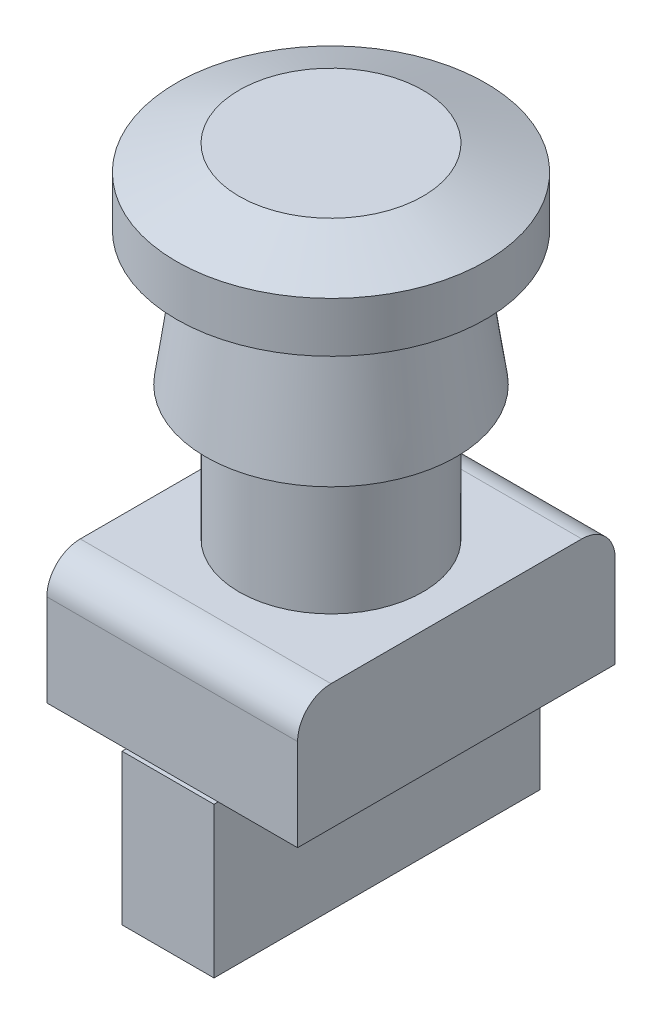
ISO-10303-21;
HEADER;
FILE_DESCRIPTION(('STEP AP214'),'2;1');
FILE_NAME('part.step','',(''),(''),'','','');
FILE_SCHEMA(('AUTOMOTIVE_DESIGN { 1 0 10303 214 1 1 1 1 }'));
ENDSEC;
DATA;
#1=APPLICATION_CONTEXT('core data for automotive mechanical design processes');
#2=APPLICATION_PROTOCOL_DEFINITION('international standard','automotive_design',2000,#1);
#3=PRODUCT_CONTEXT('',#1,'mechanical');
#4=PRODUCT('Part','Part','',(#3));
#5=PRODUCT_RELATED_PRODUCT_CATEGORY('part','',(#4));
#6=PRODUCT_DEFINITION_FORMATION('','',#4);
#7=PRODUCT_DEFINITION_CONTEXT('part definition',#1,'design');
#8=PRODUCT_DEFINITION('design','',#6,#7);
#9=PRODUCT_DEFINITION_SHAPE('','',#8);
#10=(LENGTH_UNIT() NAMED_UNIT(*) SI_UNIT(.MILLI.,.METRE.));
#11=(NAMED_UNIT(*) PLANE_ANGLE_UNIT() SI_UNIT($,.RADIAN.));
#12=(NAMED_UNIT(*) SI_UNIT($,.STERADIAN.) SOLID_ANGLE_UNIT());
#13=UNCERTAINTY_MEASURE_WITH_UNIT(LENGTH_MEASURE(1.E-05),#10,'distance_accuracy_value','');
#14=(GEOMETRIC_REPRESENTATION_CONTEXT(3) GLOBAL_UNCERTAINTY_ASSIGNED_CONTEXT((#13)) GLOBAL_UNIT_ASSIGNED_CONTEXT((#10,
#11,#12)) REPRESENTATION_CONTEXT('',''));
#15=CARTESIAN_POINT('',(0.,0.,0.));
#16=DIRECTION('',(0.,0.,1.));
#17=DIRECTION('',(1.,0.,0.));
#18=AXIS2_PLACEMENT_3D('',#15,#16,#17);
#19=CARTESIAN_POINT('',(0.,-31.,0.));
#20=DIRECTION('',(0.,1.,0.));
#21=DIRECTION('',(0.,0.,1.));
#22=AXIS2_PLACEMENT_3D('',#19,#20,#21);
#23=PLANE('',#22);
#24=DIRECTION('',(0.,0.,-1.));
#25=VECTOR('',#24,1.);
#26=CARTESIAN_POINT('',(-5.5,-31.,0.));
#27=LINE('',#26,#25);
#28=CARTESIAN_POINT('',(-5.5,-31.,19.));
#29=VERTEX_POINT('',#28);
#30=CARTESIAN_POINT('',(-5.5,-31.,-19.));
#31=VERTEX_POINT('',#30);
#32=EDGE_CURVE('E171',#29,#31,#27,.T.);
#33=ORIENTED_EDGE('',*,*,#32,.F.);
#34=DIRECTION('',(1.,0.,0.));
#35=VECTOR('',#34,1.);
#36=CARTESIAN_POINT('',(0.,-31.,19.));
#37=LINE('',#36,#35);
#38=CARTESIAN_POINT('',(-15.,-31.,19.));
#39=VERTEX_POINT('',#38);
#40=EDGE_CURVE('E176',#39,#29,#37,.T.);
#41=ORIENTED_EDGE('',*,*,#40,.F.);
#42=DIRECTION('',(0.,0.,-1.));
#43=VECTOR('',#42,1.);
#44=CARTESIAN_POINT('',(-15.,-31.,0.));
#45=LINE('',#44,#43);
#46=CARTESIAN_POINT('',(-15.,-31.,-19.));
#47=VERTEX_POINT('',#46);
#48=EDGE_CURVE('E188',#39,#47,#45,.T.);
#49=ORIENTED_EDGE('',*,*,#48,.T.);
#50=DIRECTION('',(1.,0.,0.));
#51=VECTOR('',#50,1.);
#52=CARTESIAN_POINT('',(0.,-31.,-19.));
#53=LINE('',#52,#51);
#54=EDGE_CURVE('E185',#47,#31,#53,.T.);
#55=ORIENTED_EDGE('',*,*,#54,.T.);
#56=EDGE_LOOP('',(#33,#41,#49,#55));
#57=FACE_BOUND('',#56,.T.);
#58=ADVANCED_FACE('F33',(#57),#23,.F.);
#59=CARTESIAN_POINT('',(0.,0.,0.));
#60=DIRECTION('',(0.,-1.,0.));
#61=DIRECTION('',(0.,0.,1.));
#62=AXIS2_PLACEMENT_3D('',#59,#60,#61);
#63=CONICAL_SURFACE('',#62,15.,0.139626340159547);
#64=CARTESIAN_POINT('',(0.,15.,0.));
#65=DIRECTION('',(0.,1.,0.));
#66=DIRECTION('',(0.,0.,1.));
#67=AXIS2_PLACEMENT_3D('',#64,#65,#66);
#68=CIRCLE('',#67,12.8918874794641);
#69=CARTESIAN_POINT('',(0.,15.,12.8918874794641));
#70=VERTEX_POINT('',#69);
#71=EDGE_CURVE('E213',#70,#70,#68,.T.);
#72=ORIENTED_EDGE('',*,*,#71,.F.);
#73=EDGE_LOOP('',(#72));
#74=FACE_BOUND('',#73,.T.);
#75=CARTESIAN_POINT('',(0.,0.,0.));
#76=DIRECTION('',(0.,1.,0.));
#77=DIRECTION('',(0.,0.,1.));
#78=AXIS2_PLACEMENT_3D('',#75,#76,#77);
#79=CIRCLE('',#78,15.);
#80=CARTESIAN_POINT('',(0.,0.,15.));
#81=VERTEX_POINT('',#80);
#82=EDGE_CURVE('E210',#81,#81,#79,.T.);
#83=ORIENTED_EDGE('',*,*,#82,.T.);
#84=EDGE_LOOP('',(#83));
#85=FACE_BOUND('',#84,.T.);
#86=ADVANCED_FACE('F262',(#74,#85),#63,.T.);
#87=CARTESIAN_POINT('',(0.,15.,0.));
#88=DIRECTION('',(0.,1.,0.));
#89=DIRECTION('',(0.,0.,1.));
#90=AXIS2_PLACEMENT_3D('',#87,#88,#89);
#91=PLANE('',#90);
#92=CARTESIAN_POINT('',(0.,15.,0.));
#93=DIRECTION('',(0.,1.,0.));
#94=DIRECTION('',(0.,0.,1.));
#95=AXIS2_PLACEMENT_3D('',#92,#93,#94);
#96=CIRCLE('',#95,12.);
#97=CARTESIAN_POINT('',(0.,15.,12.));
#98=VERTEX_POINT('',#97);
#99=EDGE_CURVE('E219',#98,#98,#96,.T.);
#100=ORIENTED_EDGE('',*,*,#99,.F.);
#101=EDGE_LOOP('',(#100));
#102=FACE_BOUND('',#101,.T.);
#103=ORIENTED_EDGE('',*,*,#71,.T.);
#104=EDGE_LOOP('',(#103));
#105=FACE_BOUND('',#104,.T.);
#106=ADVANCED_FACE('F268',(#102,#105),#91,.T.);
#107=CARTESIAN_POINT('',(0.,0.,0.));
#108=DIRECTION('',(0.,1.,0.));
#109=DIRECTION('',(0.,0.,1.));
#110=AXIS2_PLACEMENT_3D('',#107,#108,#109);
#111=PLANE('',#110);
#112=CARTESIAN_POINT('',(0.,0.,0.));
#113=DIRECTION('',(0.,1.,0.));
#114=DIRECTION('',(0.,0.,1.));
#115=AXIS2_PLACEMENT_3D('',#112,#113,#114);
#116=CIRCLE('',#115,11.);
#117=CARTESIAN_POINT('',(0.,0.,11.));
#118=VERTEX_POINT('',#117);
#119=EDGE_CURVE('E207',#118,#118,#116,.T.);
#120=ORIENTED_EDGE('',*,*,#119,.T.);
#121=EDGE_LOOP('',(#120));
#122=FACE_BOUND('',#121,.T.);
#123=ORIENTED_EDGE('',*,*,#82,.F.);
#124=EDGE_LOOP('',(#123));
#125=FACE_BOUND('',#124,.T.);
#126=ADVANCED_FACE('F293',(#122,#125),#111,.F.);
#127=CARTESIAN_POINT('',(0.,-16.,0.));
#128=DIRECTION('',(0.,1.,0.));
#129=DIRECTION('',(0.,0.,1.));
#130=AXIS2_PLACEMENT_3D('',#127,#128,#129);
#131=CYLINDRICAL_SURFACE('',#130,11.);
#132=CARTESIAN_POINT('',(0.,-16.,0.));
#133=DIRECTION('',(0.,1.,0.));
#134=DIRECTION('',(0.,0.,1.));
#135=AXIS2_PLACEMENT_3D('',#132,#133,#134);
#136=CIRCLE('',#135,11.);
#137=CARTESIAN_POINT('',(0.,-16.,11.));
#138=VERTEX_POINT('',#137);
#139=EDGE_CURVE('E198',#138,#138,#136,.T.);
#140=ORIENTED_EDGE('',*,*,#139,.T.);
#141=EDGE_LOOP('',(#140));
#142=FACE_BOUND('',#141,.T.);
#143=ORIENTED_EDGE('',*,*,#119,.F.);
#144=EDGE_LOOP('',(#143));
#145=FACE_BOUND('',#144,.T.);
#146=ADVANCED_FACE('F290',(#142,#145),#131,.T.);
#147=CARTESIAN_POINT('',(0.,-31.,19.));
#148=DIRECTION('',(0.,0.,1.));
#149=DIRECTION('',(1.,0.,0.));
#150=AXIS2_PLACEMENT_3D('',#147,#148,#149);
#151=PLANE('',#150);
#152=DIRECTION('',(0.,1.,0.));
#153=VECTOR('',#152,1.);
#154=CARTESIAN_POINT('',(15.,-31.,19.));
#155=LINE('',#154,#153);
#156=CARTESIAN_POINT('',(15.,-31.,19.));
#157=VERTEX_POINT('',#156);
#158=CARTESIAN_POINT('',(15.,-20.,19.));
#159=VERTEX_POINT('',#158);
#160=EDGE_CURVE('E191',#157,#159,#155,.T.);
#161=ORIENTED_EDGE('',*,*,#160,.T.);
#162=DIRECTION('',(1.,0.,0.));
#163=VECTOR('',#162,1.);
#164=CARTESIAN_POINT('',(0.,-20.,19.));
#165=LINE('',#164,#163);
#166=CARTESIAN_POINT('',(-15.,-20.,19.));
#167=VERTEX_POINT('',#166);
#168=EDGE_CURVE('E56',#159,#167,#165,.F.);
#169=ORIENTED_EDGE('',*,*,#168,.T.);
#170=DIRECTION('',(0.,1.,0.));
#171=VECTOR('',#170,1.);
#172=CARTESIAN_POINT('',(-15.,-31.,19.));
#173=LINE('',#172,#171);
#174=EDGE_CURVE('E196',#39,#167,#173,.T.);
#175=ORIENTED_EDGE('',*,*,#174,.F.);
#176=ORIENTED_EDGE('',*,*,#40,.T.);
#177=CARTESIAN_POINT('',(5.5,-31.,19.));
#178=VERTEX_POINT('',#177);
#179=EDGE_CURVE('E180',#29,#178,#37,.T.);
#180=ORIENTED_EDGE('',*,*,#179,.T.);
#181=EDGE_CURVE('E181',#178,#157,#37,.T.);
#182=ORIENTED_EDGE('',*,*,#181,.T.);
#183=EDGE_LOOP('',(#161,#169,#175,#176,#180,#182));
#184=FACE_BOUND('',#183,.T.);
#185=ADVANCED_FACE('F242',(#184),#151,.T.);
#186=CARTESIAN_POINT('',(-15.,-31.,0.));
#187=DIRECTION('',(1.,0.,0.));
#188=DIRECTION('',(0.,0.,-1.));
#189=AXIS2_PLACEMENT_3D('',#186,#187,#188);
#190=PLANE('',#189);
#191=ORIENTED_EDGE('',*,*,#174,.T.);
#192=CARTESIAN_POINT('',(-15.,-20.,15.));
#193=DIRECTION('',(1.,0.,0.));
#194=DIRECTION('',(0.,0.,-1.));
#195=AXIS2_PLACEMENT_3D('',#192,#193,#194);
#196=CIRCLE('',#195,4.);
#197=CARTESIAN_POINT('',(-15.,-16.,15.));
#198=VERTEX_POINT('',#197);
#199=EDGE_CURVE('E41',#167,#198,#196,.F.);
#200=ORIENTED_EDGE('',*,*,#199,.T.);
#201=DIRECTION('',(0.,0.,-1.));
#202=VECTOR('',#201,1.);
#203=CARTESIAN_POINT('',(-15.,-16.,0.));
#204=LINE('',#203,#202);
#205=CARTESIAN_POINT('',(-15.,-16.,-15.));
#206=VERTEX_POINT('',#205);
#207=EDGE_CURVE('E194',#198,#206,#204,.T.);
#208=ORIENTED_EDGE('',*,*,#207,.T.);
#209=CARTESIAN_POINT('',(-15.,-20.,-15.));
#210=DIRECTION('',(1.,0.,0.));
#211=DIRECTION('',(0.,0.,-1.));
#212=AXIS2_PLACEMENT_3D('',#209,#210,#211);
#213=CIRCLE('',#212,4.);
#214=CARTESIAN_POINT('',(-15.,-20.,-19.));
#215=VERTEX_POINT('',#214);
#216=EDGE_CURVE('E48',#206,#215,#213,.F.);
#217=ORIENTED_EDGE('',*,*,#216,.T.);
#218=DIRECTION('',(0.,1.,0.));
#219=VECTOR('',#218,1.);
#220=CARTESIAN_POINT('',(-15.,-31.,-19.));
#221=LINE('',#220,#219);
#222=EDGE_CURVE('E199',#47,#215,#221,.T.);
#223=ORIENTED_EDGE('',*,*,#222,.F.);
#224=ORIENTED_EDGE('',*,*,#48,.F.);
#225=EDGE_LOOP('',(#191,#200,#208,#217,#223,#224));
#226=FACE_BOUND('',#225,.T.);
#227=ADVANCED_FACE('F229',(#226),#190,.F.);
#228=CARTESIAN_POINT('',(0.,-31.,-19.));
#229=DIRECTION('',(0.,0.,1.));
#230=DIRECTION('',(1.,0.,0.));
#231=AXIS2_PLACEMENT_3D('',#228,#229,#230);
#232=PLANE('',#231);
#233=ORIENTED_EDGE('',*,*,#222,.T.);
#234=DIRECTION('',(1.,0.,0.));
#235=VECTOR('',#234,1.);
#236=CARTESIAN_POINT('',(15.,-20.,-19.));
#237=LINE('',#236,#235);
#238=CARTESIAN_POINT('',(15.,-20.,-19.));
#239=VERTEX_POINT('',#238);
#240=EDGE_CURVE('E11',#215,#239,#237,.T.);
#241=ORIENTED_EDGE('',*,*,#240,.T.);
#242=DIRECTION('',(0.,1.,0.));
#243=VECTOR('',#242,1.);
#244=CARTESIAN_POINT('',(15.,-31.,-19.));
#245=LINE('',#244,#243);
#246=CARTESIAN_POINT('',(15.,-31.,-19.));
#247=VERTEX_POINT('',#246);
#248=EDGE_CURVE('E201',#247,#239,#245,.T.);
#249=ORIENTED_EDGE('',*,*,#248,.F.);
#250=CARTESIAN_POINT('',(5.5,-31.,-19.));
#251=VERTEX_POINT('',#250);
#252=EDGE_CURVE('E184',#251,#247,#53,.T.);
#253=ORIENTED_EDGE('',*,*,#252,.F.);
#254=EDGE_CURVE('E189',#31,#251,#53,.T.);
#255=ORIENTED_EDGE('',*,*,#254,.F.);
#256=ORIENTED_EDGE('',*,*,#54,.F.);
#257=EDGE_LOOP('',(#233,#241,#249,#253,#255,#256));
#258=FACE_BOUND('',#257,.T.);
#259=ADVANCED_FACE('F251',(#258),#232,.F.);
#260=CARTESIAN_POINT('',(15.,-31.,0.));
#261=DIRECTION('',(1.,0.,0.));
#262=DIRECTION('',(0.,0.,-1.));
#263=AXIS2_PLACEMENT_3D('',#260,#261,#262);
#264=PLANE('',#263);
#265=DIRECTION('',(0.,0.,-1.));
#266=VECTOR('',#265,1.);
#267=CARTESIAN_POINT('',(15.,-16.,0.));
#268=LINE('',#267,#266);
#269=CARTESIAN_POINT('',(15.,-16.,15.));
#270=VERTEX_POINT('',#269);
#271=CARTESIAN_POINT('',(15.,-16.,-15.));
#272=VERTEX_POINT('',#271);
#273=EDGE_CURVE('E146',#270,#272,#268,.T.);
#274=ORIENTED_EDGE('',*,*,#273,.F.);
#275=CARTESIAN_POINT('',(15.,-20.,15.));
#276=DIRECTION('',(1.,0.,0.));
#277=DIRECTION('',(0.,0.,-1.));
#278=AXIS2_PLACEMENT_3D('',#275,#276,#277);
#279=CIRCLE('',#278,4.);
#280=EDGE_CURVE('E224',#270,#159,#279,.T.);
#281=ORIENTED_EDGE('',*,*,#280,.T.);
#282=ORIENTED_EDGE('',*,*,#160,.F.);
#283=DIRECTION('',(0.,0.,-1.));
#284=VECTOR('',#283,1.);
#285=CARTESIAN_POINT('',(15.,-31.,0.));
#286=LINE('',#285,#284);
#287=EDGE_CURVE('E179',#157,#247,#286,.T.);
#288=ORIENTED_EDGE('',*,*,#287,.T.);
#289=ORIENTED_EDGE('',*,*,#248,.T.);
#290=CARTESIAN_POINT('',(15.,-20.,-15.));
#291=DIRECTION('',(1.,0.,0.));
#292=DIRECTION('',(0.,0.,-1.));
#293=AXIS2_PLACEMENT_3D('',#290,#291,#292);
#294=CIRCLE('',#293,4.);
#295=EDGE_CURVE('E222',#239,#272,#294,.T.);
#296=ORIENTED_EDGE('',*,*,#295,.T.);
#297=EDGE_LOOP('',(#274,#281,#282,#288,#289,#296));
#298=FACE_BOUND('',#297,.T.);
#299=ADVANCED_FACE('F240',(#298),#264,.T.);
#300=ORIENTED_EDGE('',*,*,#181,.F.);
#301=DIRECTION('',(0.,0.,-1.));
#302=VECTOR('',#301,1.);
#303=CARTESIAN_POINT('',(5.5,-31.,0.));
#304=LINE('',#303,#302);
#305=EDGE_CURVE('E165',#178,#251,#304,.T.);
#306=ORIENTED_EDGE('',*,*,#305,.T.);
#307=ORIENTED_EDGE('',*,*,#252,.T.);
#308=ORIENTED_EDGE('',*,*,#287,.F.);
#309=EDGE_LOOP('',(#300,#306,#307,#308));
#310=FACE_BOUND('',#309,.T.);
#311=ADVANCED_FACE('F247',(#310),#23,.F.);
#312=CARTESIAN_POINT('',(0.,-16.,0.));
#313=DIRECTION('',(0.,1.,0.));
#314=DIRECTION('',(0.,0.,1.));
#315=AXIS2_PLACEMENT_3D('',#312,#313,#314);
#316=PLANE('',#315);
#317=ORIENTED_EDGE('',*,*,#139,.F.);
#318=EDGE_LOOP('',(#317));
#319=FACE_BOUND('',#318,.T.);
#320=ORIENTED_EDGE('',*,*,#207,.F.);
#321=DIRECTION('',(1.,0.,0.));
#322=VECTOR('',#321,1.);
#323=CARTESIAN_POINT('',(0.,-16.,15.));
#324=LINE('',#323,#322);
#325=EDGE_CURVE('E218',#198,#270,#324,.T.);
#326=ORIENTED_EDGE('',*,*,#325,.T.);
#327=ORIENTED_EDGE('',*,*,#273,.T.);
#328=DIRECTION('',(1.,0.,0.));
#329=VECTOR('',#328,1.);
#330=CARTESIAN_POINT('',(-15.,-16.,-15.));
#331=LINE('',#330,#329);
#332=EDGE_CURVE('E216',#272,#206,#331,.F.);
#333=ORIENTED_EDGE('',*,*,#332,.T.);
#334=EDGE_LOOP('',(#320,#326,#327,#333));
#335=FACE_BOUND('',#334,.T.);
#336=ADVANCED_FACE('F234',(#319,#335),#316,.T.);
#337=CARTESIAN_POINT('',(0.,-31.,0.));
#338=DIRECTION('',(0.,1.,0.));
#339=DIRECTION('',(0.,0.,1.));
#340=AXIS2_PLACEMENT_3D('',#337,#338,#339);
#341=PLANE('',#340);
#342=ORIENTED_EDGE('',*,*,#179,.F.);
#343=CARTESIAN_POINT('',(-5.5,-31.,19.5));
#344=VERTEX_POINT('',#343);
#345=EDGE_CURVE('E137',#344,#29,#27,.T.);
#346=ORIENTED_EDGE('',*,*,#345,.F.);
#347=DIRECTION('',(1.,0.,0.));
#348=VECTOR('',#347,1.);
#349=CARTESIAN_POINT('',(0.,-31.,19.5));
#350=LINE('',#349,#348);
#351=CARTESIAN_POINT('',(5.5,-31.,19.5));
#352=VERTEX_POINT('',#351);
#353=EDGE_CURVE('E164',#344,#352,#350,.T.);
#354=ORIENTED_EDGE('',*,*,#353,.T.);
#355=EDGE_CURVE('E161',#352,#178,#304,.T.);
#356=ORIENTED_EDGE('',*,*,#355,.T.);
#357=EDGE_LOOP('',(#342,#346,#354,#356));
#358=FACE_BOUND('',#357,.T.);
#359=ADVANCED_FACE('F279',(#358),#341,.T.);
#360=CARTESIAN_POINT('',(0.,-49.,-19.5));
#361=DIRECTION('',(0.,0.,1.));
#362=DIRECTION('',(1.,0.,0.));
#363=AXIS2_PLACEMENT_3D('',#360,#361,#362);
#364=PLANE('',#363);
#365=DIRECTION('',(1.,0.,0.));
#366=VECTOR('',#365,1.);
#367=CARTESIAN_POINT('',(0.,-31.,-19.5));
#368=LINE('',#367,#366);
#369=CARTESIAN_POINT('',(-5.5,-31.,-19.5));
#370=VERTEX_POINT('',#369);
#371=CARTESIAN_POINT('',(5.5,-31.,-19.5));
#372=VERTEX_POINT('',#371);
#373=EDGE_CURVE('E144',#370,#372,#368,.T.);
#374=ORIENTED_EDGE('',*,*,#373,.T.);
#375=DIRECTION('',(0.,1.,0.));
#376=VECTOR('',#375,1.);
#377=CARTESIAN_POINT('',(5.5,-49.,-19.5));
#378=LINE('',#377,#376);
#379=CARTESIAN_POINT('',(5.5,-49.,-19.5));
#380=VERTEX_POINT('',#379);
#381=EDGE_CURVE('E141',#380,#372,#378,.T.);
#382=ORIENTED_EDGE('',*,*,#381,.F.);
#383=DIRECTION('',(1.,0.,0.));
#384=VECTOR('',#383,1.);
#385=CARTESIAN_POINT('',(0.,-49.,-19.5));
#386=LINE('',#385,#384);
#387=CARTESIAN_POINT('',(-5.5,-49.,-19.5));
#388=VERTEX_POINT('',#387);
#389=EDGE_CURVE('E125',#388,#380,#386,.T.);
#390=ORIENTED_EDGE('',*,*,#389,.F.);
#391=DIRECTION('',(0.,1.,0.));
#392=VECTOR('',#391,1.);
#393=CARTESIAN_POINT('',(-5.5,-49.,-19.5));
#394=LINE('',#393,#392);
#395=EDGE_CURVE('E157',#388,#370,#394,.T.);
#396=ORIENTED_EDGE('',*,*,#395,.T.);
#397=EDGE_LOOP('',(#374,#382,#390,#396));
#398=FACE_BOUND('',#397,.T.);
#399=ADVANCED_FACE('F142',(#398),#364,.F.);
#400=CARTESIAN_POINT('',(5.5,-49.,0.));
#401=DIRECTION('',(1.,0.,0.));
#402=DIRECTION('',(0.,0.,-1.));
#403=AXIS2_PLACEMENT_3D('',#400,#401,#402);
#404=PLANE('',#403);
#405=ORIENTED_EDGE('',*,*,#355,.F.);
#406=DIRECTION('',(0.,1.,0.));
#407=VECTOR('',#406,1.);
#408=CARTESIAN_POINT('',(5.5,-49.,19.5));
#409=LINE('',#408,#407);
#410=CARTESIAN_POINT('',(5.5,-49.,19.5));
#411=VERTEX_POINT('',#410);
#412=EDGE_CURVE('E147',#411,#352,#409,.T.);
#413=ORIENTED_EDGE('',*,*,#412,.F.);
#414=DIRECTION('',(0.,0.,-1.));
#415=VECTOR('',#414,1.);
#416=CARTESIAN_POINT('',(5.5,-49.,0.));
#417=LINE('',#416,#415);
#418=EDGE_CURVE('E130',#411,#380,#417,.T.);
#419=ORIENTED_EDGE('',*,*,#418,.T.);
#420=ORIENTED_EDGE('',*,*,#381,.T.);
#421=EDGE_CURVE('E159',#251,#372,#304,.T.);
#422=ORIENTED_EDGE('',*,*,#421,.F.);
#423=ORIENTED_EDGE('',*,*,#305,.F.);
#424=EDGE_LOOP('',(#405,#413,#419,#420,#422,#423));
#425=FACE_BOUND('',#424,.T.);
#426=ADVANCED_FACE('F150',(#425),#404,.T.);
#427=CARTESIAN_POINT('',(0.,-49.,19.5));
#428=DIRECTION('',(0.,0.,1.));
#429=DIRECTION('',(1.,0.,0.));
#430=AXIS2_PLACEMENT_3D('',#427,#428,#429);
#431=PLANE('',#430);
#432=ORIENTED_EDGE('',*,*,#353,.F.);
#433=DIRECTION('',(0.,1.,0.));
#434=VECTOR('',#433,1.);
#435=CARTESIAN_POINT('',(-5.5,-49.,19.5));
#436=LINE('',#435,#434);
#437=CARTESIAN_POINT('',(-5.5,-49.,19.5));
#438=VERTEX_POINT('',#437);
#439=EDGE_CURVE('E173',#438,#344,#436,.T.);
#440=ORIENTED_EDGE('',*,*,#439,.F.);
#441=DIRECTION('',(1.,0.,0.));
#442=VECTOR('',#441,1.);
#443=CARTESIAN_POINT('',(0.,-49.,19.5));
#444=LINE('',#443,#442);
#445=EDGE_CURVE('E151',#438,#411,#444,.T.);
#446=ORIENTED_EDGE('',*,*,#445,.T.);
#447=ORIENTED_EDGE('',*,*,#412,.T.);
#448=EDGE_LOOP('',(#432,#440,#446,#447));
#449=FACE_BOUND('',#448,.T.);
#450=ADVANCED_FACE('F412',(#449),#431,.T.);
#451=CARTESIAN_POINT('',(-5.5,-49.,0.));
#452=DIRECTION('',(1.,0.,0.));
#453=DIRECTION('',(0.,0.,-1.));
#454=AXIS2_PLACEMENT_3D('',#451,#452,#453);
#455=PLANE('',#454);
#456=ORIENTED_EDGE('',*,*,#345,.T.);
#457=ORIENTED_EDGE('',*,*,#32,.T.);
#458=EDGE_CURVE('E168',#31,#370,#27,.T.);
#459=ORIENTED_EDGE('',*,*,#458,.T.);
#460=ORIENTED_EDGE('',*,*,#395,.F.);
#461=DIRECTION('',(0.,0.,-1.));
#462=VECTOR('',#461,1.);
#463=CARTESIAN_POINT('',(-5.5,-49.,0.));
#464=LINE('',#463,#462);
#465=EDGE_CURVE('E133',#438,#388,#464,.T.);
#466=ORIENTED_EDGE('',*,*,#465,.F.);
#467=ORIENTED_EDGE('',*,*,#439,.T.);
#468=EDGE_LOOP('',(#456,#457,#459,#460,#466,#467));
#469=FACE_BOUND('',#468,.T.);
#470=ADVANCED_FACE('F405',(#469),#455,.F.);
#471=CARTESIAN_POINT('',(0.,-49.,0.));
#472=DIRECTION('',(0.,1.,0.));
#473=DIRECTION('',(0.,0.,1.));
#474=AXIS2_PLACEMENT_3D('',#471,#472,#473);
#475=PLANE('',#474);
#476=ORIENTED_EDGE('',*,*,#389,.T.);
#477=ORIENTED_EDGE('',*,*,#418,.F.);
#478=ORIENTED_EDGE('',*,*,#445,.F.);
#479=ORIENTED_EDGE('',*,*,#465,.T.);
#480=EDGE_LOOP('',(#476,#477,#478,#479));
#481=FACE_BOUND('',#480,.T.);
#482=ADVANCED_FACE('F127',(#481),#475,.F.);
#483=ORIENTED_EDGE('',*,*,#458,.F.);
#484=ORIENTED_EDGE('',*,*,#254,.T.);
#485=ORIENTED_EDGE('',*,*,#421,.T.);
#486=ORIENTED_EDGE('',*,*,#373,.F.);
#487=EDGE_LOOP('',(#483,#484,#485,#486));
#488=FACE_BOUND('',#487,.T.);
#489=ADVANCED_FACE('F390',(#488),#341,.T.);
#490=CARTESIAN_POINT('',(0.,25.,0.));
#491=DIRECTION('',(0.,-1.,0.));
#492=DIRECTION('',(0.,0.,-1.));
#493=AXIS2_PLACEMENT_3D('',#490,#491,#492);
#494=PLANE('',#493);
#495=CARTESIAN_POINT('',(0.,25.,0.));
#496=DIRECTION('',(0.,1.,0.));
#497=DIRECTION('',(0.,0.,1.));
#498=AXIS2_PLACEMENT_3D('',#495,#496,#497);
#499=CIRCLE('',#498,11.);
#500=CARTESIAN_POINT('',(0.,25.,11.));
#501=VERTEX_POINT('',#500);
#502=EDGE_CURVE('E160',#501,#501,#499,.T.);
#503=ORIENTED_EDGE('',*,*,#502,.T.);
#504=EDGE_LOOP('',(#503));
#505=FACE_BOUND('',#504,.T.);
#506=ADVANCED_FACE('F382',(#505),#494,.F.);
#507=CARTESIAN_POINT('',(0.,22.,0.));
#508=DIRECTION('',(0.,-1.,0.));
#509=DIRECTION('',(0.,0.,-1.));
#510=AXIS2_PLACEMENT_3D('',#507,#508,#509);
#511=CONICAL_SURFACE('',#510,18.5,1.19028994968253);
#512=ORIENTED_EDGE('',*,*,#502,.F.);
#513=EDGE_LOOP('',(#512));
#514=FACE_BOUND('',#513,.T.);
#515=CARTESIAN_POINT('',(0.,22.,0.));
#516=DIRECTION('',(0.,1.,0.));
#517=DIRECTION('',(0.,0.,1.));
#518=AXIS2_PLACEMENT_3D('',#515,#516,#517);
#519=CIRCLE('',#518,18.5);
#520=CARTESIAN_POINT('',(0.,22.,18.5));
#521=VERTEX_POINT('',#520);
#522=EDGE_CURVE('E485',#521,#521,#519,.T.);
#523=ORIENTED_EDGE('',*,*,#522,.T.);
#524=EDGE_LOOP('',(#523));
#525=FACE_BOUND('',#524,.T.);
#526=ADVANCED_FACE('F374',(#514,#525),#511,.T.);
#527=CARTESIAN_POINT('',(0.,34.0750592113001,0.));
#528=DIRECTION('',(0.,1.,0.));
#529=DIRECTION('',(0.,0.,1.));
#530=AXIS2_PLACEMENT_3D('',#527,#528,#529);
#531=CYLINDRICAL_SURFACE('',#530,18.5);
#532=ORIENTED_EDGE('',*,*,#522,.F.);
#533=EDGE_LOOP('',(#532));
#534=FACE_BOUND('',#533,.T.);
#535=CARTESIAN_POINT('',(0.,16.,0.));
#536=DIRECTION('',(0.,1.,0.));
#537=DIRECTION('',(0.,0.,1.));
#538=AXIS2_PLACEMENT_3D('',#535,#536,#537);
#539=CIRCLE('',#538,18.5);
#540=CARTESIAN_POINT('',(0.,16.,18.5));
#541=VERTEX_POINT('',#540);
#542=EDGE_CURVE('E482',#541,#541,#539,.T.);
#543=ORIENTED_EDGE('',*,*,#542,.T.);
#544=EDGE_LOOP('',(#543));
#545=FACE_BOUND('',#544,.T.);
#546=ADVANCED_FACE('F366',(#534,#545),#531,.T.);
#547=CARTESIAN_POINT('',(0.,16.,-18.5));
#548=DIRECTION('',(0.,1.,0.));
#549=DIRECTION('',(0.,0.,1.));
#550=AXIS2_PLACEMENT_3D('',#547,#548,#549);
#551=PLANE('',#550);
#552=ORIENTED_EDGE('',*,*,#542,.F.);
#553=EDGE_LOOP('',(#552));
#554=FACE_BOUND('',#553,.T.);
#555=CARTESIAN_POINT('',(0.,16.,0.));
#556=DIRECTION('',(0.,1.,0.));
#557=DIRECTION('',(0.,0.,1.));
#558=AXIS2_PLACEMENT_3D('',#555,#556,#557);
#559=CIRCLE('',#558,12.);
#560=CARTESIAN_POINT('',(0.,16.,12.));
#561=VERTEX_POINT('',#560);
#562=EDGE_CURVE('E479',#561,#561,#559,.T.);
#563=ORIENTED_EDGE('',*,*,#562,.T.);
#564=EDGE_LOOP('',(#563));
#565=FACE_BOUND('',#564,.T.);
#566=ADVANCED_FACE('F359',(#554,#565),#551,.F.);
#567=CARTESIAN_POINT('',(0.,34.0750592113001,0.));
#568=DIRECTION('',(0.,1.,0.));
#569=DIRECTION('',(0.,0.,1.));
#570=AXIS2_PLACEMENT_3D('',#567,#568,#569);
#571=CYLINDRICAL_SURFACE('',#570,12.);
#572=ORIENTED_EDGE('',*,*,#562,.F.);
#573=EDGE_LOOP('',(#572));
#574=FACE_BOUND('',#573,.T.);
#575=ORIENTED_EDGE('',*,*,#99,.T.);
#576=EDGE_LOOP('',(#575));
#577=FACE_BOUND('',#576,.T.);
#578=ADVANCED_FACE('F260',(#574,#577),#571,.T.);
#579=CARTESIAN_POINT('',(0.,-20.,15.));
#580=DIRECTION('',(1.,0.,0.));
#581=DIRECTION('',(0.,0.,-1.));
#582=AXIS2_PLACEMENT_3D('',#579,#580,#581);
#583=CYLINDRICAL_SURFACE('',#582,4.);
#584=ORIENTED_EDGE('',*,*,#199,.F.);
#585=ORIENTED_EDGE('',*,*,#168,.F.);
#586=ORIENTED_EDGE('',*,*,#280,.F.);
#587=ORIENTED_EDGE('',*,*,#325,.F.);
#588=EDGE_LOOP('',(#584,#585,#586,#587));
#589=FACE_BOUND('',#588,.T.);
#590=ADVANCED_FACE('F237',(#589),#583,.T.);
#591=CARTESIAN_POINT('',(0.,-20.,-15.));
#592=DIRECTION('',(-1.,0.,0.));
#593=DIRECTION('',(0.,0.,1.));
#594=AXIS2_PLACEMENT_3D('',#591,#592,#593);
#595=CYLINDRICAL_SURFACE('',#594,4.);
#596=ORIENTED_EDGE('',*,*,#216,.F.);
#597=ORIENTED_EDGE('',*,*,#332,.F.);
#598=ORIENTED_EDGE('',*,*,#295,.F.);
#599=ORIENTED_EDGE('',*,*,#240,.F.);
#600=EDGE_LOOP('',(#596,#597,#598,#599));
#601=FACE_BOUND('',#600,.T.);
#602=ADVANCED_FACE('F35',(#601),#595,.T.);
#603=CLOSED_SHELL('',(#58,#86,#106,#126,#146,#185,#227,#259,#299,#311,#336,#359,#399,#426,#450,
#470,#482,#489,#506,#526,#546,#566,#578,#590,#602));
#604=MANIFOLD_SOLID_BREP('B2',#603);
#605=ADVANCED_BREP_SHAPE_REPRESENTATION('',(#18,#604),#14);
#606=SHAPE_DEFINITION_REPRESENTATION(#9,#605);
ENDSEC;
END-ISO-10303-21;
